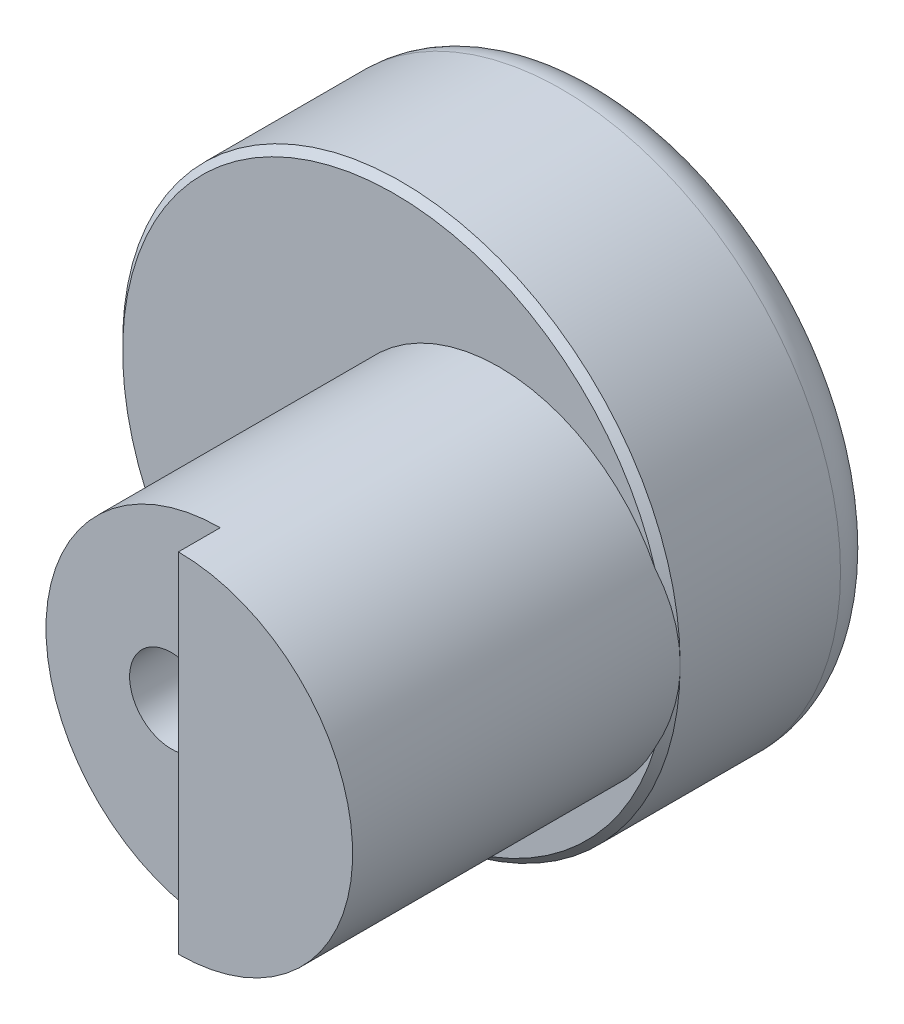
ISO-10303-21;
HEADER;
FILE_DESCRIPTION(('STEP AP214'),'2;1');
FILE_NAME('part.step','',(''),(''),'','','');
FILE_SCHEMA(('AUTOMOTIVE_DESIGN { 1 0 10303 214 1 1 1 1 }'));
ENDSEC;
DATA;
#1=APPLICATION_CONTEXT('core data for automotive mechanical design processes');
#2=APPLICATION_PROTOCOL_DEFINITION('international standard','automotive_design',2000,#1);
#3=PRODUCT_CONTEXT('',#1,'mechanical');
#4=PRODUCT('Part','Part','',(#3));
#5=PRODUCT_RELATED_PRODUCT_CATEGORY('part','',(#4));
#6=PRODUCT_DEFINITION_FORMATION('','',#4);
#7=PRODUCT_DEFINITION_CONTEXT('part definition',#1,'design');
#8=PRODUCT_DEFINITION('design','',#6,#7);
#9=PRODUCT_DEFINITION_SHAPE('','',#8);
#10=(LENGTH_UNIT() NAMED_UNIT(*) SI_UNIT(.MILLI.,.METRE.));
#11=(NAMED_UNIT(*) PLANE_ANGLE_UNIT() SI_UNIT($,.RADIAN.));
#12=(NAMED_UNIT(*) SI_UNIT($,.STERADIAN.) SOLID_ANGLE_UNIT());
#13=UNCERTAINTY_MEASURE_WITH_UNIT(LENGTH_MEASURE(1.E-05),#10,'distance_accuracy_value','');
#14=(GEOMETRIC_REPRESENTATION_CONTEXT(3) GLOBAL_UNCERTAINTY_ASSIGNED_CONTEXT((#13)) GLOBAL_UNIT_ASSIGNED_CONTEXT((#10,
#11,#12)) REPRESENTATION_CONTEXT('',''));
#15=CARTESIAN_POINT('',(0.,0.,0.));
#16=DIRECTION('',(0.,0.,1.));
#17=DIRECTION('',(1.,0.,0.));
#18=AXIS2_PLACEMENT_3D('',#15,#16,#17);
#19=CARTESIAN_POINT('',(4.,0.,0.));
#20=DIRECTION('',(0.,0.,1.));
#21=DIRECTION('',(1.,0.,0.));
#22=AXIS2_PLACEMENT_3D('',#19,#20,#21);
#23=CYLINDRICAL_SURFACE('',#22,3.);
#24=CARTESIAN_POINT('',(4.,0.,0.));
#25=DIRECTION('',(0.,0.,1.));
#26=DIRECTION('',(1.,0.,0.));
#27=AXIS2_PLACEMENT_3D('',#24,#25,#26);
#28=CIRCLE('',#27,3.);
#29=CARTESIAN_POINT('',(7.,0.,0.));
#30=VERTEX_POINT('',#29);
#31=EDGE_CURVE('E82',#30,#30,#28,.T.);
#32=ORIENTED_EDGE('',*,*,#31,.F.);
#33=EDGE_LOOP('',(#32));
#34=FACE_BOUND('',#33,.T.);
#35=CARTESIAN_POINT('',(4.,0.,35.));
#36=DIRECTION('',(0.,0.,1.));
#37=DIRECTION('',(1.,0.,0.));
#38=AXIS2_PLACEMENT_3D('',#35,#36,#37);
#39=CIRCLE('',#38,3.);
#40=CARTESIAN_POINT('',(7.,0.,35.));
#41=VERTEX_POINT('',#40);
#42=EDGE_CURVE('E42',#41,#41,#39,.F.);
#43=ORIENTED_EDGE('',*,*,#42,.F.);
#44=EDGE_LOOP('',(#43));
#45=FACE_BOUND('',#44,.T.);
#46=ADVANCED_FACE('F36',(#34,#45),#23,.F.);
#47=CARTESIAN_POINT('',(0.,0.,15.));
#48=DIRECTION('',(0.,0.,-1.));
#49=DIRECTION('',(-1.,0.,0.));
#50=AXIS2_PLACEMENT_3D('',#47,#48,#49);
#51=CYLINDRICAL_SURFACE('',#50,20.);
#52=CARTESIAN_POINT('',(0.,0.,14.5));
#53=DIRECTION('',(0.,0.,1.));
#54=DIRECTION('',(1.,0.,0.));
#55=AXIS2_PLACEMENT_3D('',#52,#53,#54);
#56=CIRCLE('',#55,20.);
#57=CARTESIAN_POINT('',(20.,0.,14.5));
#58=VERTEX_POINT('',#57);
#59=EDGE_CURVE('E62',#58,#58,#56,.F.);
#60=ORIENTED_EDGE('',*,*,#59,.T.);
#61=EDGE_LOOP('',(#60));
#62=FACE_BOUND('',#61,.T.);
#63=CARTESIAN_POINT('',(0.,0.,3.));
#64=DIRECTION('',(0.,0.,1.));
#65=DIRECTION('',(1.,0.,0.));
#66=AXIS2_PLACEMENT_3D('',#63,#64,#65);
#67=CIRCLE('',#66,20.);
#68=CARTESIAN_POINT('',(20.,0.,3.));
#69=VERTEX_POINT('',#68);
#70=EDGE_CURVE('E101',#69,#69,#67,.T.);
#71=ORIENTED_EDGE('',*,*,#70,.T.);
#72=EDGE_LOOP('',(#71));
#73=FACE_BOUND('',#72,.T.);
#74=ADVANCED_FACE('F134',(#62,#73),#51,.T.);
#75=CARTESIAN_POINT('',(0.,0.,15.));
#76=DIRECTION('',(0.,0.,1.));
#77=DIRECTION('',(1.,0.,0.));
#78=AXIS2_PLACEMENT_3D('',#75,#76,#77);
#79=PLANE('',#78);
#80=CARTESIAN_POINT('',(7.5,0.,15.));
#81=DIRECTION('',(0.,0.,1.));
#82=DIRECTION('',(1.,0.,0.));
#83=AXIS2_PLACEMENT_3D('',#80,#81,#82);
#84=CIRCLE('',#83,12.5);
#85=CARTESIAN_POINT('',(18.6833333333333,5.5841790404281,15.));
#86=VERTEX_POINT('',#85);
#87=CARTESIAN_POINT('',(18.6833333333333,-5.5841790404281,15.));
#88=VERTEX_POINT('',#87);
#89=EDGE_CURVE('E99',#86,#88,#84,.T.);
#90=ORIENTED_EDGE('',*,*,#89,.F.);
#91=CARTESIAN_POINT('',(0.,0.,15.));
#92=DIRECTION('',(0.,0.,1.));
#93=DIRECTION('',(1.,0.,0.));
#94=AXIS2_PLACEMENT_3D('',#91,#92,#93);
#95=CIRCLE('',#94,19.5);
#96=EDGE_CURVE('E109',#86,#88,#95,.T.);
#97=ORIENTED_EDGE('',*,*,#96,.T.);
#98=EDGE_LOOP('',(#90,#97));
#99=FACE_BOUND('',#98,.T.);
#100=ADVANCED_FACE('F130',(#99),#79,.T.);
#101=CARTESIAN_POINT('',(0.,0.,0.));
#102=DIRECTION('',(0.,0.,1.));
#103=DIRECTION('',(1.,0.,0.));
#104=AXIS2_PLACEMENT_3D('',#101,#102,#103);
#105=PLANE('',#104);
#106=CARTESIAN_POINT('',(0.,0.,0.));
#107=DIRECTION('',(0.,0.,1.));
#108=DIRECTION('',(1.,0.,0.));
#109=AXIS2_PLACEMENT_3D('',#106,#107,#108);
#110=CIRCLE('',#109,17.);
#111=CARTESIAN_POINT('',(17.,0.,0.));
#112=VERTEX_POINT('',#111);
#113=EDGE_CURVE('E106',#112,#112,#110,.F.);
#114=ORIENTED_EDGE('',*,*,#113,.T.);
#115=EDGE_LOOP('',(#114));
#116=FACE_BOUND('',#115,.T.);
#117=ORIENTED_EDGE('',*,*,#31,.T.);
#118=EDGE_LOOP('',(#117));
#119=FACE_BOUND('',#118,.T.);
#120=ADVANCED_FACE('F128',(#116,#119),#105,.F.);
#121=CARTESIAN_POINT('',(7.5,0.,38.));
#122=DIRECTION('',(0.,0.,-1.));
#123=DIRECTION('',(-1.,0.,0.));
#124=AXIS2_PLACEMENT_3D('',#121,#122,#123);
#125=CYLINDRICAL_SURFACE('',#124,12.5);
#126=CARTESIAN_POINT('',(7.5,0.,38.));
#127=DIRECTION('',(0.,0.,1.));
#128=DIRECTION('',(1.,0.,0.));
#129=AXIS2_PLACEMENT_3D('',#126,#127,#128);
#130=CIRCLE('',#129,12.5);
#131=CARTESIAN_POINT('',(7.50000000000008,-12.5,38.));
#132=VERTEX_POINT('',#131);
#133=CARTESIAN_POINT('',(7.49999999999995,12.5,38.));
#134=VERTEX_POINT('',#133);
#135=EDGE_CURVE('E92',#132,#134,#130,.T.);
#136=ORIENTED_EDGE('',*,*,#135,.F.);
#137=DIRECTION('',(0.,0.,1.));
#138=VECTOR('',#137,1.);
#139=CARTESIAN_POINT('',(7.50000000000013,-12.5,35.));
#140=LINE('',#139,#138);
#141=CARTESIAN_POINT('',(7.50000000000013,-12.5,35.));
#142=VERTEX_POINT('',#141);
#143=EDGE_CURVE('E54',#142,#132,#140,.T.);
#144=ORIENTED_EDGE('',*,*,#143,.F.);
#145=CARTESIAN_POINT('',(7.5,0.,35.));
#146=DIRECTION('',(0.,0.,1.));
#147=DIRECTION('',(1.,0.,0.));
#148=AXIS2_PLACEMENT_3D('',#145,#146,#147);
#149=CIRCLE('',#148,12.5);
#150=CARTESIAN_POINT('',(7.49999999999995,12.5,35.));
#151=VERTEX_POINT('',#150);
#152=EDGE_CURVE('E77',#151,#142,#149,.T.);
#153=ORIENTED_EDGE('',*,*,#152,.F.);
#154=DIRECTION('',(0.,0.,1.));
#155=VECTOR('',#154,1.);
#156=CARTESIAN_POINT('',(7.49999999999995,12.5,35.));
#157=LINE('',#156,#155);
#158=EDGE_CURVE('E85',#151,#134,#157,.T.);
#159=ORIENTED_EDGE('',*,*,#158,.T.);
#160=EDGE_LOOP('',(#136,#144,#153,#159));
#161=FACE_BOUND('',#160,.T.);
#162=CARTESIAN_POINT('',(18.6833333333333,-5.58417904042808,15.));
#163=CARTESIAN_POINT('',(18.8314253634293,-5.28770036829446,14.9430478234618));
#164=CARTESIAN_POINT('',(18.9680138973102,-4.98455526958181,14.8907572994275));
#165=CARTESIAN_POINT('',(19.2171151279469,-4.3669040711178,14.7957097785799));
#166=CARTESIAN_POINT('',(19.3296154959488,-4.05239224946329,14.7529576632266));
#167=CARTESIAN_POINT('',(19.5272839196272,-3.42078602327319,14.6780268876181));
#168=CARTESIAN_POINT('',(19.6129620787014,-3.10387474526127,14.6456505759043));
#169=CARTESIAN_POINT('',(19.7592059538056,-2.4636584106481,14.5904834026309));
#170=CARTESIAN_POINT('',(19.8197850357225,-2.1403568533864,14.567687439203));
#171=CARTESIAN_POINT('',(19.9113630216918,-1.51628867646245,14.5332594187843));
#172=CARTESIAN_POINT('',(19.9443875779731,-1.21585963252604,14.5208624002));
#173=CARTESIAN_POINT('',(19.9888258847901,-0.610305336987047,14.5041904102427));
#174=CARTESIAN_POINT('',(20.0000309002966,-0.305162605820208,14.4999938869855));
#175=CARTESIAN_POINT('',(20.,0.,14.5));
#176=B_SPLINE_CURVE_WITH_KNOTS('',3,(#162,#163,#164,#165,#166,#167,#168,#169,#170,#171,#172,
#173,#174,#175),.UNSPECIFIED.,.F.,.F.,(4,2,2,2,2,2,4),(0.,1.00854008907075,2.01759513959549,
3.00609464094805,3.9940670628822,4.90065258714167,5.81586909623253),.UNSPECIFIED.);
#177=EDGE_CURVE('E47',#88,#58,#176,.T.);
#178=ORIENTED_EDGE('',*,*,#177,.T.);
#179=CARTESIAN_POINT('',(20.,0.,14.5));
#180=CARTESIAN_POINT('',(20.0000004039324,0.168153538589132,14.5000002335852));
#181=CARTESIAN_POINT('',(19.9966062754309,0.336285325723158,14.5012725968712));
#182=CARTESIAN_POINT('',(19.9830431217709,0.672236361123067,14.5063596073101));
#183=CARTESIAN_POINT('',(19.9728741184033,0.840055610392469,14.5101742462859));
#184=CARTESIAN_POINT('',(19.932225365788,1.34265065524566,14.5254288695228));
#185=CARTESIAN_POINT('',(19.8916038753582,1.67655566067134,14.5406795598962));
#186=CARTESIAN_POINT('',(19.7848239554402,2.33267784457246,14.5808446016072));
#187=CARTESIAN_POINT('',(19.7191966425314,2.65499495629893,14.605558017621));
#188=CARTESIAN_POINT('',(19.5630431049016,3.29251148609327,14.6645138119858));
#189=CARTESIAN_POINT('',(19.4725281828301,3.60771406506196,14.6987518648279));
#190=CARTESIAN_POINT('',(19.2758764678734,4.20343209397264,14.7733826703009));
#191=CARTESIAN_POINT('',(19.1716356319557,4.48466891527266,14.8130380711731));
#192=CARTESIAN_POINT('',(18.9426530381485,5.04054344951572,14.9004673094935));
#193=CARTESIAN_POINT('',(18.8177270432841,5.31509380642612,14.9483142501723));
#194=CARTESIAN_POINT('',(18.6833333333333,5.58417904042808,15.));
#195=B_SPLINE_CURVE_WITH_KNOTS('',3,(#179,#180,#181,#182,#183,#184,#185,#186,#187,#188,#189,
#190,#191,#192,#193,#194),.UNSPECIFIED.,.F.,.F.,(4,2,2,2,2,2,2,4),(0.,0.504378201649742,
1.00875478100569,2.01753212014252,3.00598059058626,3.99398089881973,4.90075966752592,
5.8160983078179),.UNSPECIFIED.);
#196=EDGE_CURVE('E11',#58,#86,#195,.T.);
#197=ORIENTED_EDGE('',*,*,#196,.T.);
#198=ORIENTED_EDGE('',*,*,#89,.T.);
#199=EDGE_LOOP('',(#178,#197,#198));
#200=FACE_BOUND('',#199,.T.);
#201=ADVANCED_FACE('F89',(#161,#200),#125,.T.);
#202=CARTESIAN_POINT('',(7.5,0.,38.));
#203=DIRECTION('',(0.,0.,1.));
#204=DIRECTION('',(1.,0.,0.));
#205=AXIS2_PLACEMENT_3D('',#202,#203,#204);
#206=PLANE('',#205);
#207=DIRECTION('',(0.,1.,0.));
#208=VECTOR('',#207,1.);
#209=CARTESIAN_POINT('',(7.49999999999995,12.5,38.));
#210=LINE('',#209,#208);
#211=EDGE_CURVE('E86',#132,#134,#210,.T.);
#212=ORIENTED_EDGE('',*,*,#211,.F.);
#213=ORIENTED_EDGE('',*,*,#135,.T.);
#214=EDGE_LOOP('',(#212,#213));
#215=FACE_BOUND('',#214,.T.);
#216=ADVANCED_FACE('F127',(#215),#206,.T.);
#217=CARTESIAN_POINT('',(0.,0.,3.));
#218=DIRECTION('',(0.,0.,1.));
#219=DIRECTION('',(1.,0.,0.));
#220=AXIS2_PLACEMENT_3D('',#217,#218,#219);
#221=TOROIDAL_SURFACE('',#220,17.,3.);
#222=ORIENTED_EDGE('',*,*,#113,.F.);
#223=EDGE_LOOP('',(#222));
#224=FACE_BOUND('',#223,.T.);
#225=ORIENTED_EDGE('',*,*,#70,.F.);
#226=EDGE_LOOP('',(#225));
#227=FACE_BOUND('',#226,.T.);
#228=ADVANCED_FACE('F141',(#224,#227),#221,.T.);
#229=CARTESIAN_POINT('',(0.,0.,15.));
#230=DIRECTION('',(0.,0.,-1.));
#231=DIRECTION('',(-1.,0.,0.));
#232=AXIS2_PLACEMENT_3D('',#229,#230,#231);
#233=CONICAL_SURFACE('',#232,19.5,0.785398163397452);
#234=ORIENTED_EDGE('',*,*,#196,.F.);
#235=ORIENTED_EDGE('',*,*,#59,.F.);
#236=ORIENTED_EDGE('',*,*,#177,.F.);
#237=ORIENTED_EDGE('',*,*,#96,.F.);
#238=EDGE_LOOP('',(#234,#235,#236,#237));
#239=FACE_BOUND('',#238,.T.);
#240=ADVANCED_FACE('F39',(#239),#233,.T.);
#241=CARTESIAN_POINT('',(4.,0.,35.));
#242=DIRECTION('',(0.,0.,1.));
#243=DIRECTION('',(1.,0.,0.));
#244=AXIS2_PLACEMENT_3D('',#241,#242,#243);
#245=PLANE('',#244);
#246=ORIENTED_EDGE('',*,*,#42,.T.);
#247=EDGE_LOOP('',(#246));
#248=FACE_BOUND('',#247,.T.);
#249=ORIENTED_EDGE('',*,*,#152,.T.);
#250=DIRECTION('',(0.,1.,0.));
#251=VECTOR('',#250,1.);
#252=CARTESIAN_POINT('',(7.49999999999995,12.5,35.));
#253=LINE('',#252,#251);
#254=EDGE_CURVE('E79',#142,#151,#253,.T.);
#255=ORIENTED_EDGE('',*,*,#254,.T.);
#256=EDGE_LOOP('',(#249,#255));
#257=FACE_BOUND('',#256,.T.);
#258=ADVANCED_FACE('F78',(#248,#257),#245,.T.);
#259=CARTESIAN_POINT('',(7.49999999999995,12.5,35.));
#260=DIRECTION('',(1.,0.,0.));
#261=DIRECTION('',(0.,1.,0.));
#262=AXIS2_PLACEMENT_3D('',#259,#260,#261);
#263=PLANE('',#262);
#264=ORIENTED_EDGE('',*,*,#211,.T.);
#265=ORIENTED_EDGE('',*,*,#158,.F.);
#266=ORIENTED_EDGE('',*,*,#254,.F.);
#267=ORIENTED_EDGE('',*,*,#143,.T.);
#268=EDGE_LOOP('',(#264,#265,#266,#267));
#269=FACE_BOUND('',#268,.T.);
#270=ADVANCED_FACE('F84',(#269),#263,.F.);
#271=CLOSED_SHELL('',(#46,#74,#100,#120,#201,#216,#228,#240,#258,#270));
#272=MANIFOLD_SOLID_BREP('B2',#271);
#273=ADVANCED_BREP_SHAPE_REPRESENTATION('',(#18,#272),#14);
#274=SHAPE_DEFINITION_REPRESENTATION(#9,#273);
ENDSEC;
END-ISO-10303-21;
